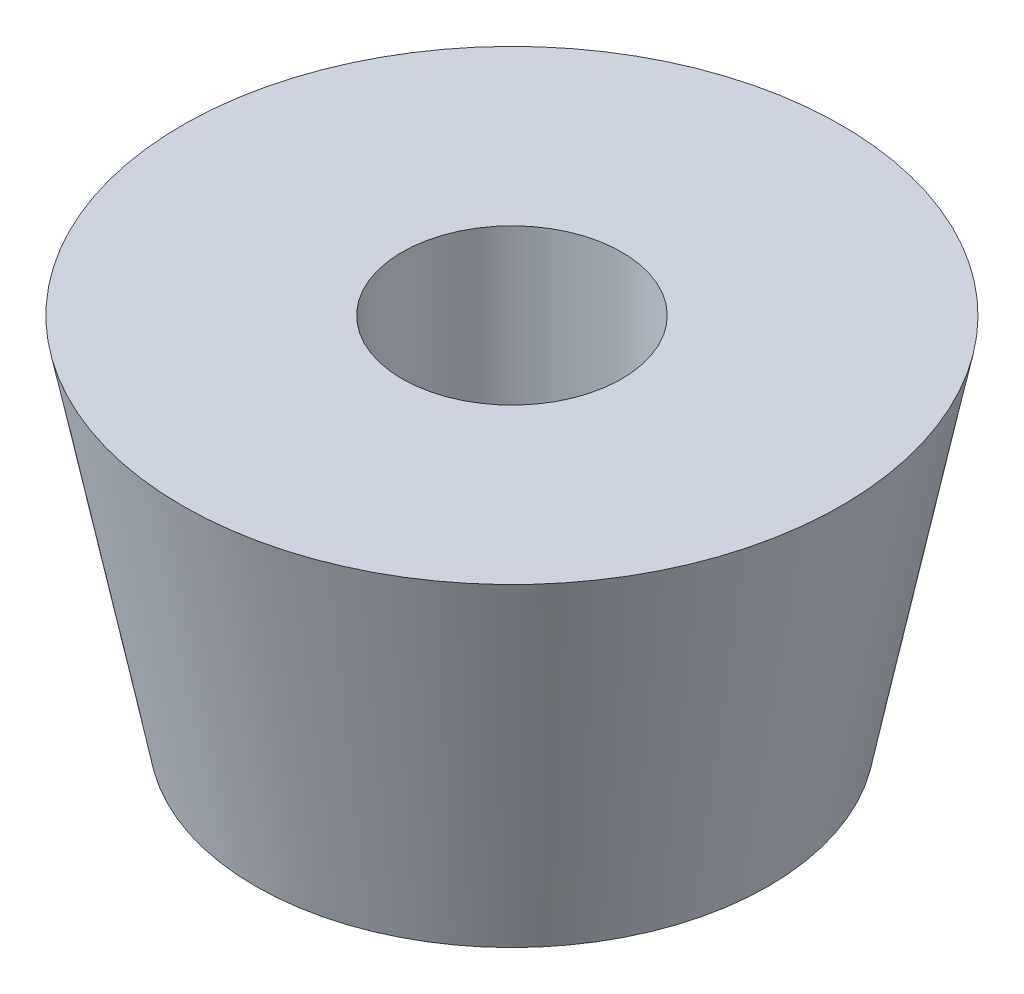
ISO-10303-21;
HEADER;
FILE_DESCRIPTION(('STEP AP214'),'2;1');
FILE_NAME('part.step','',(''),(''),'','','');
FILE_SCHEMA(('AUTOMOTIVE_DESIGN { 1 0 10303 214 1 1 1 1 }'));
ENDSEC;
DATA;
#1=APPLICATION_CONTEXT('core data for automotive mechanical design processes');
#2=APPLICATION_PROTOCOL_DEFINITION('international standard','automotive_design',2000,#1);
#3=PRODUCT_CONTEXT('',#1,'mechanical');
#4=PRODUCT('Part','Part','',(#3));
#5=PRODUCT_RELATED_PRODUCT_CATEGORY('part','',(#4));
#6=PRODUCT_DEFINITION_FORMATION('','',#4);
#7=PRODUCT_DEFINITION_CONTEXT('part definition',#1,'design');
#8=PRODUCT_DEFINITION('design','',#6,#7);
#9=PRODUCT_DEFINITION_SHAPE('','',#8);
#10=(LENGTH_UNIT() NAMED_UNIT(*) SI_UNIT(.MILLI.,.METRE.));
#11=(NAMED_UNIT(*) PLANE_ANGLE_UNIT() SI_UNIT($,.RADIAN.));
#12=(NAMED_UNIT(*) SI_UNIT($,.STERADIAN.) SOLID_ANGLE_UNIT());
#13=UNCERTAINTY_MEASURE_WITH_UNIT(LENGTH_MEASURE(1.E-05),#10,'distance_accuracy_value','');
#14=(GEOMETRIC_REPRESENTATION_CONTEXT(3) GLOBAL_UNCERTAINTY_ASSIGNED_CONTEXT((#13)) GLOBAL_UNIT_ASSIGNED_CONTEXT((#10,
#11,#12)) REPRESENTATION_CONTEXT('',''));
#15=CARTESIAN_POINT('',(0.,0.,0.));
#16=DIRECTION('',(0.,0.,1.));
#17=DIRECTION('',(1.,0.,0.));
#18=AXIS2_PLACEMENT_3D('',#15,#16,#17);
#19=CARTESIAN_POINT('',(0.,0.,0.));
#20=DIRECTION('',(0.,1.,0.));
#21=DIRECTION('',(0.,0.,1.));
#22=AXIS2_PLACEMENT_3D('',#19,#20,#21);
#23=CYLINDRICAL_SURFACE('',#22,1.5);
#24=CARTESIAN_POINT('',(0.,-5.,0.));
#25=DIRECTION('',(0.,1.,0.));
#26=DIRECTION('',(0.,0.,1.));
#27=AXIS2_PLACEMENT_3D('',#24,#25,#26);
#28=CIRCLE('',#27,1.5);
#29=CARTESIAN_POINT('',(0.,-5.,1.5));
#30=VERTEX_POINT('',#29);
#31=EDGE_CURVE('E45',#30,#30,#28,.T.);
#32=ORIENTED_EDGE('',*,*,#31,.F.);
#33=EDGE_LOOP('',(#32));
#34=FACE_BOUND('',#33,.T.);
#35=CARTESIAN_POINT('',(0.,0.,0.));
#36=DIRECTION('',(0.,1.,0.));
#37=DIRECTION('',(0.,0.,1.));
#38=AXIS2_PLACEMENT_3D('',#35,#36,#37);
#39=CIRCLE('',#38,1.5);
#40=CARTESIAN_POINT('',(0.,0.,1.5));
#41=VERTEX_POINT('',#40);
#42=EDGE_CURVE('E10',#41,#41,#39,.T.);
#43=ORIENTED_EDGE('',*,*,#42,.T.);
#44=EDGE_LOOP('',(#43));
#45=FACE_BOUND('',#44,.T.);
#46=ADVANCED_FACE('F31',(#34,#45),#23,.F.);
#47=CARTESIAN_POINT('',(0.,0.,-1.5));
#48=DIRECTION('',(0.,-1.,0.));
#49=DIRECTION('',(0.,0.,-1.));
#50=AXIS2_PLACEMENT_3D('',#47,#48,#49);
#51=PLANE('',#50);
#52=ORIENTED_EDGE('',*,*,#42,.F.);
#53=EDGE_LOOP('',(#52));
#54=FACE_BOUND('',#53,.T.);
#55=CARTESIAN_POINT('',(0.,0.,0.));
#56=DIRECTION('',(0.,1.,0.));
#57=DIRECTION('',(0.,0.,1.));
#58=AXIS2_PLACEMENT_3D('',#55,#56,#57);
#59=CIRCLE('',#58,4.5);
#60=CARTESIAN_POINT('',(0.,0.,4.5));
#61=VERTEX_POINT('',#60);
#62=EDGE_CURVE('E37',#61,#61,#59,.T.);
#63=ORIENTED_EDGE('',*,*,#62,.T.);
#64=EDGE_LOOP('',(#63));
#65=FACE_BOUND('',#64,.T.);
#66=ADVANCED_FACE('F54',(#54,#65),#51,.F.);
#67=CARTESIAN_POINT('',(0.,-5.,0.));
#68=DIRECTION('',(0.,1.,0.));
#69=DIRECTION('',(0.,0.,1.));
#70=AXIS2_PLACEMENT_3D('',#67,#68,#69);
#71=CONICAL_SURFACE('',#70,3.5,0.197395559849881);
#72=ORIENTED_EDGE('',*,*,#62,.F.);
#73=EDGE_LOOP('',(#72));
#74=FACE_BOUND('',#73,.T.);
#75=CARTESIAN_POINT('',(0.,-5.,0.));
#76=DIRECTION('',(0.,1.,0.));
#77=DIRECTION('',(0.,0.,1.));
#78=AXIS2_PLACEMENT_3D('',#75,#76,#77);
#79=CIRCLE('',#78,3.5);
#80=CARTESIAN_POINT('',(0.,-5.,3.5));
#81=VERTEX_POINT('',#80);
#82=EDGE_CURVE('E41',#81,#81,#79,.T.);
#83=ORIENTED_EDGE('',*,*,#82,.T.);
#84=EDGE_LOOP('',(#83));
#85=FACE_BOUND('',#84,.T.);
#86=ADVANCED_FACE('F58',(#74,#85),#71,.T.);
#87=CARTESIAN_POINT('',(0.,-5.,-3.5));
#88=DIRECTION('',(0.,1.,0.));
#89=DIRECTION('',(0.,0.,1.));
#90=AXIS2_PLACEMENT_3D('',#87,#88,#89);
#91=PLANE('',#90);
#92=ORIENTED_EDGE('',*,*,#82,.F.);
#93=EDGE_LOOP('',(#92));
#94=FACE_BOUND('',#93,.T.);
#95=ORIENTED_EDGE('',*,*,#31,.T.);
#96=EDGE_LOOP('',(#95));
#97=FACE_BOUND('',#96,.T.);
#98=ADVANCED_FACE('F51',(#94,#97),#91,.F.);
#99=CLOSED_SHELL('',(#46,#66,#86,#98));
#100=MANIFOLD_SOLID_BREP('B2',#99);
#101=ADVANCED_BREP_SHAPE_REPRESENTATION('',(#18,#100),#14);
#102=SHAPE_DEFINITION_REPRESENTATION(#9,#101);
ENDSEC;
END-ISO-10303-21;
